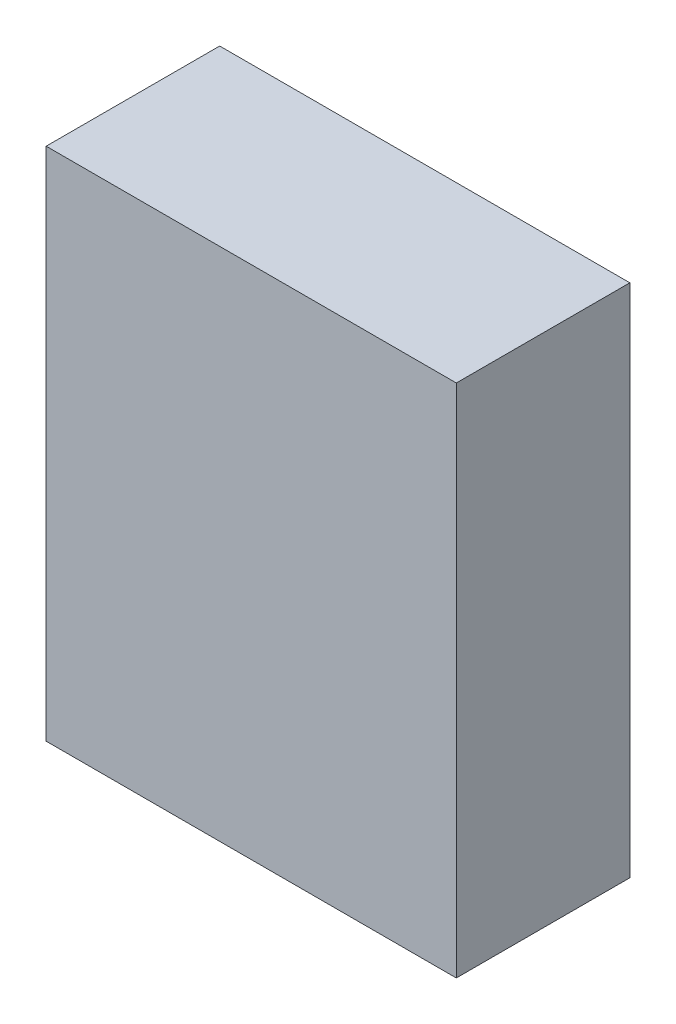
ISO-10303-21;
HEADER;
FILE_DESCRIPTION(('STEP AP214'),'2;1');
FILE_NAME('part.step','',(''),(''),'','','');
FILE_SCHEMA(('AUTOMOTIVE_DESIGN { 1 0 10303 214 1 1 1 1 }'));
ENDSEC;
DATA;
#1=APPLICATION_CONTEXT('core data for automotive mechanical design processes');
#2=APPLICATION_PROTOCOL_DEFINITION('international standard','automotive_design',2000,#1);
#3=PRODUCT_CONTEXT('',#1,'mechanical');
#4=PRODUCT('Part','Part','',(#3));
#5=PRODUCT_RELATED_PRODUCT_CATEGORY('part','',(#4));
#6=PRODUCT_DEFINITION_FORMATION('','',#4);
#7=PRODUCT_DEFINITION_CONTEXT('part definition',#1,'design');
#8=PRODUCT_DEFINITION('design','',#6,#7);
#9=PRODUCT_DEFINITION_SHAPE('','',#8);
#10=(LENGTH_UNIT() NAMED_UNIT(*) SI_UNIT(.MILLI.,.METRE.));
#11=(NAMED_UNIT(*) PLANE_ANGLE_UNIT() SI_UNIT($,.RADIAN.));
#12=(NAMED_UNIT(*) SI_UNIT($,.STERADIAN.) SOLID_ANGLE_UNIT());
#13=UNCERTAINTY_MEASURE_WITH_UNIT(LENGTH_MEASURE(1.E-05),#10,'distance_accuracy_value','');
#14=(GEOMETRIC_REPRESENTATION_CONTEXT(3) GLOBAL_UNCERTAINTY_ASSIGNED_CONTEXT((#13)) GLOBAL_UNIT_ASSIGNED_CONTEXT((#10,
#11,#12)) REPRESENTATION_CONTEXT('',''));
#15=CARTESIAN_POINT('',(0.,0.,0.));
#16=DIRECTION('',(0.,0.,1.));
#17=DIRECTION('',(1.,0.,0.));
#18=AXIS2_PLACEMENT_3D('',#15,#16,#17);
#19=CARTESIAN_POINT('',(-1.94999864,-2.45000018,1.64999924));
#20=DIRECTION('',(0.,0.,1.));
#21=DIRECTION('',(1.,0.,0.));
#22=AXIS2_PLACEMENT_3D('',#19,#20,#21);
#23=PLANE('',#22);
#24=DIRECTION('',(1.,0.,0.));
#25=VECTOR('',#24,1.);
#26=CARTESIAN_POINT('',(-1.94999864,2.45000018,1.64999924));
#27=LINE('',#26,#25);
#28=CARTESIAN_POINT('',(-1.94999864,2.45000018,1.64999924));
#29=VERTEX_POINT('',#28);
#30=CARTESIAN_POINT('',(1.95000118,2.45000018,1.64999924));
#31=VERTEX_POINT('',#30);
#32=EDGE_CURVE('E52',#29,#31,#27,.T.);
#33=ORIENTED_EDGE('',*,*,#32,.F.);
#34=DIRECTION('',(0.,1.,0.));
#35=VECTOR('',#34,1.);
#36=CARTESIAN_POINT('',(-1.94999864,-2.45000018,1.64999924));
#37=LINE('',#36,#35);
#38=CARTESIAN_POINT('',(-1.94999864,-2.45000018,1.64999924));
#39=VERTEX_POINT('',#38);
#40=EDGE_CURVE('E67',#39,#29,#37,.T.);
#41=ORIENTED_EDGE('',*,*,#40,.F.);
#42=DIRECTION('',(1.,0.,0.));
#43=VECTOR('',#42,1.);
#44=CARTESIAN_POINT('',(1.95000118,-2.45000018,1.64999924));
#45=LINE('',#44,#43);
#46=CARTESIAN_POINT('',(1.95000118,-2.45000018,1.64999924));
#47=VERTEX_POINT('',#46);
#48=EDGE_CURVE('E19',#47,#39,#45,.F.);
#49=ORIENTED_EDGE('',*,*,#48,.F.);
#50=DIRECTION('',(0.,1.,0.));
#51=VECTOR('',#50,1.);
#52=CARTESIAN_POINT('',(1.95000118,2.45000018,1.64999924));
#53=LINE('',#52,#51);
#54=EDGE_CURVE('E57',#31,#47,#53,.F.);
#55=ORIENTED_EDGE('',*,*,#54,.F.);
#56=EDGE_LOOP('',(#33,#41,#49,#55));
#57=FACE_BOUND('',#56,.T.);
#58=ADVANCED_FACE('F16',(#57),#23,.T.);
#59=CARTESIAN_POINT('',(1.95000118,-2.45000018,0.));
#60=DIRECTION('',(0.,-1.,0.));
#61=DIRECTION('',(0.,0.,-1.));
#62=AXIS2_PLACEMENT_3D('',#59,#60,#61);
#63=PLANE('',#62);
#64=DIRECTION('',(0.,0.,1.));
#65=VECTOR('',#64,1.);
#66=CARTESIAN_POINT('',(-1.94999864,-2.45000018,0.));
#67=LINE('',#66,#65);
#68=CARTESIAN_POINT('',(-1.94999864,-2.45000018,0.));
#69=VERTEX_POINT('',#68);
#70=EDGE_CURVE('E78',#69,#39,#67,.T.);
#71=ORIENTED_EDGE('',*,*,#70,.F.);
#72=DIRECTION('',(1.,0.,0.));
#73=VECTOR('',#72,1.);
#74=CARTESIAN_POINT('',(-1.94999864,-2.45000018,0.));
#75=LINE('',#74,#73);
#76=CARTESIAN_POINT('',(1.95000118,-2.45000018,0.));
#77=VERTEX_POINT('',#76);
#78=EDGE_CURVE('E73',#69,#77,#75,.T.);
#79=ORIENTED_EDGE('',*,*,#78,.T.);
#80=DIRECTION('',(0.,0.,-1.));
#81=VECTOR('',#80,1.);
#82=CARTESIAN_POINT('',(1.95000118,-2.45000018,0.));
#83=LINE('',#82,#81);
#84=EDGE_CURVE('E62',#47,#77,#83,.T.);
#85=ORIENTED_EDGE('',*,*,#84,.F.);
#86=ORIENTED_EDGE('',*,*,#48,.T.);
#87=EDGE_LOOP('',(#71,#79,#85,#86));
#88=FACE_BOUND('',#87,.T.);
#89=ADVANCED_FACE('F72',(#88),#63,.T.);
#90=CARTESIAN_POINT('',(1.95000118,2.45000018,0.));
#91=DIRECTION('',(1.,0.,0.));
#92=DIRECTION('',(0.,0.,-1.));
#93=AXIS2_PLACEMENT_3D('',#90,#91,#92);
#94=PLANE('',#93);
#95=ORIENTED_EDGE('',*,*,#84,.T.);
#96=DIRECTION('',(0.,1.,0.));
#97=VECTOR('',#96,1.);
#98=CARTESIAN_POINT('',(1.95000118,-2.45000018,0.));
#99=LINE('',#98,#97);
#100=CARTESIAN_POINT('',(1.95000118,2.45000018,0.));
#101=VERTEX_POINT('',#100);
#102=EDGE_CURVE('E83',#77,#101,#99,.T.);
#103=ORIENTED_EDGE('',*,*,#102,.T.);
#104=DIRECTION('',(0.,0.,1.));
#105=VECTOR('',#104,1.);
#106=CARTESIAN_POINT('',(1.95000118,2.45000018,0.));
#107=LINE('',#106,#105);
#108=EDGE_CURVE('E64',#31,#101,#107,.F.);
#109=ORIENTED_EDGE('',*,*,#108,.F.);
#110=ORIENTED_EDGE('',*,*,#54,.T.);
#111=EDGE_LOOP('',(#95,#103,#109,#110));
#112=FACE_BOUND('',#111,.T.);
#113=ADVANCED_FACE('F59',(#112),#94,.T.);
#114=CARTESIAN_POINT('',(-1.94999864,2.45000018,0.));
#115=DIRECTION('',(0.,1.,0.));
#116=DIRECTION('',(0.,0.,1.));
#117=AXIS2_PLACEMENT_3D('',#114,#115,#116);
#118=PLANE('',#117);
#119=ORIENTED_EDGE('',*,*,#108,.T.);
#120=DIRECTION('',(1.,0.,0.));
#121=VECTOR('',#120,1.);
#122=CARTESIAN_POINT('',(-1.94999864,2.45000018,0.));
#123=LINE('',#122,#121);
#124=CARTESIAN_POINT('',(-1.94999864,2.45000018,0.));
#125=VERTEX_POINT('',#124);
#126=EDGE_CURVE('E25',#101,#125,#123,.F.);
#127=ORIENTED_EDGE('',*,*,#126,.T.);
#128=DIRECTION('',(0.,0.,1.));
#129=VECTOR('',#128,1.);
#130=CARTESIAN_POINT('',(-1.94999864,2.45000018,0.));
#131=LINE('',#130,#129);
#132=EDGE_CURVE('E33',#29,#125,#131,.F.);
#133=ORIENTED_EDGE('',*,*,#132,.F.);
#134=ORIENTED_EDGE('',*,*,#32,.T.);
#135=EDGE_LOOP('',(#119,#127,#133,#134));
#136=FACE_BOUND('',#135,.T.);
#137=ADVANCED_FACE('F87',(#136),#118,.T.);
#138=CARTESIAN_POINT('',(-1.94999864,-2.45000018,0.));
#139=DIRECTION('',(-1.,0.,0.));
#140=DIRECTION('',(0.,0.,1.));
#141=AXIS2_PLACEMENT_3D('',#138,#139,#140);
#142=PLANE('',#141);
#143=ORIENTED_EDGE('',*,*,#132,.T.);
#144=DIRECTION('',(0.,1.,0.));
#145=VECTOR('',#144,1.);
#146=CARTESIAN_POINT('',(-1.94999864,-2.45000018,0.));
#147=LINE('',#146,#145);
#148=EDGE_CURVE('E11',#125,#69,#147,.F.);
#149=ORIENTED_EDGE('',*,*,#148,.T.);
#150=ORIENTED_EDGE('',*,*,#70,.T.);
#151=ORIENTED_EDGE('',*,*,#40,.T.);
#152=EDGE_LOOP('',(#143,#149,#150,#151));
#153=FACE_BOUND('',#152,.T.);
#154=ADVANCED_FACE('F90',(#153),#142,.T.);
#155=CARTESIAN_POINT('',(-1.94999864,-2.45000018,0.));
#156=DIRECTION('',(0.,0.,1.));
#157=DIRECTION('',(1.,0.,0.));
#158=AXIS2_PLACEMENT_3D('',#155,#156,#157);
#159=PLANE('',#158);
#160=ORIENTED_EDGE('',*,*,#126,.F.);
#161=ORIENTED_EDGE('',*,*,#102,.F.);
#162=ORIENTED_EDGE('',*,*,#78,.F.);
#163=ORIENTED_EDGE('',*,*,#148,.F.);
#164=EDGE_LOOP('',(#160,#161,#162,#163));
#165=FACE_BOUND('',#164,.T.);
#166=ADVANCED_FACE('F89',(#165),#159,.F.);
#167=CLOSED_SHELL('',(#58,#89,#113,#137,#154,#166));
#168=MANIFOLD_SOLID_BREP('B1',#167);
#169=ADVANCED_BREP_SHAPE_REPRESENTATION('',(#18,#168),#14);
#170=SHAPE_DEFINITION_REPRESENTATION(#9,#169);
ENDSEC;
END-ISO-10303-21;
